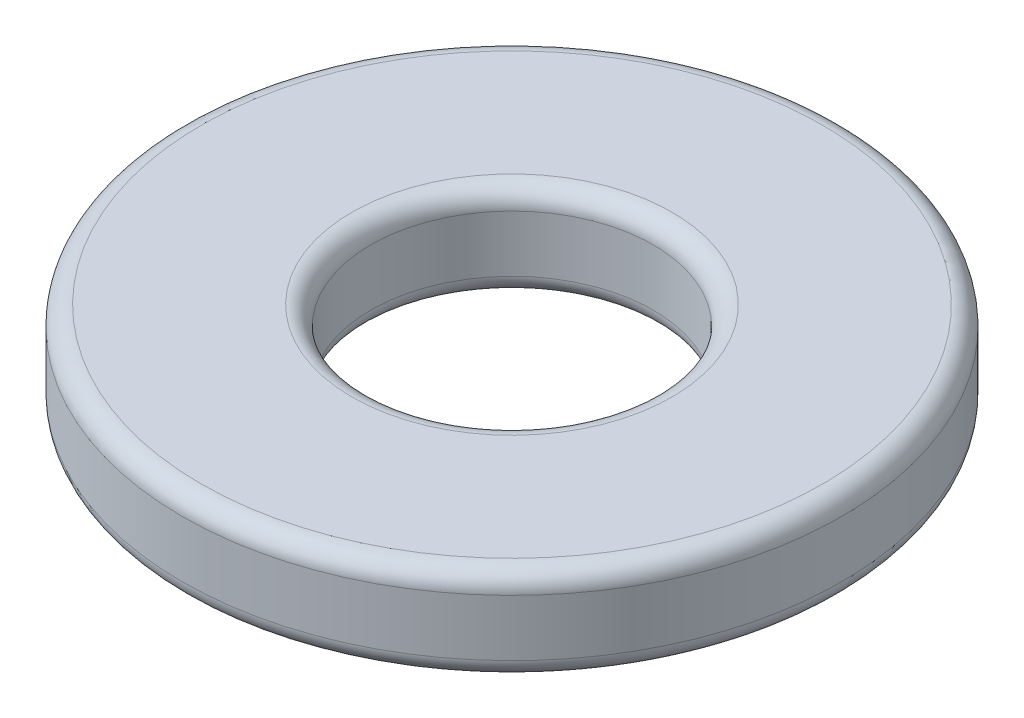
ISO-10303-21;
HEADER;
FILE_DESCRIPTION(('STEP AP214'),'2;1');
FILE_NAME('part.step','',(''),(''),'','','');
FILE_SCHEMA(('AUTOMOTIVE_DESIGN { 1 0 10303 214 1 1 1 1 }'));
ENDSEC;
DATA;
#1=APPLICATION_CONTEXT('core data for automotive mechanical design processes');
#2=APPLICATION_PROTOCOL_DEFINITION('international standard','automotive_design',2000,#1);
#3=PRODUCT_CONTEXT('',#1,'mechanical');
#4=PRODUCT('Part','Part','',(#3));
#5=PRODUCT_RELATED_PRODUCT_CATEGORY('part','',(#4));
#6=PRODUCT_DEFINITION_FORMATION('','',#4);
#7=PRODUCT_DEFINITION_CONTEXT('part definition',#1,'design');
#8=PRODUCT_DEFINITION('design','',#6,#7);
#9=PRODUCT_DEFINITION_SHAPE('','',#8);
#10=(LENGTH_UNIT() NAMED_UNIT(*) SI_UNIT(.MILLI.,.METRE.));
#11=(NAMED_UNIT(*) PLANE_ANGLE_UNIT() SI_UNIT($,.RADIAN.));
#12=(NAMED_UNIT(*) SI_UNIT($,.STERADIAN.) SOLID_ANGLE_UNIT());
#13=UNCERTAINTY_MEASURE_WITH_UNIT(LENGTH_MEASURE(1.E-05),#10,'distance_accuracy_value','');
#14=(GEOMETRIC_REPRESENTATION_CONTEXT(3) GLOBAL_UNCERTAINTY_ASSIGNED_CONTEXT((#13)) GLOBAL_UNIT_ASSIGNED_CONTEXT((#10,
#11,#12)) REPRESENTATION_CONTEXT('',''));
#15=CARTESIAN_POINT('',(0.,0.,0.));
#16=DIRECTION('',(0.,0.,1.));
#17=DIRECTION('',(1.,0.,0.));
#18=AXIS2_PLACEMENT_3D('',#15,#16,#17);
#19=CARTESIAN_POINT('',(0.,1.,0.));
#20=DIRECTION('',(0.,1.,0.));
#21=DIRECTION('',(0.,0.,1.));
#22=AXIS2_PLACEMENT_3D('',#19,#20,#21);
#23=PLANE('',#22);
#24=CARTESIAN_POINT('',(0.,1.,0.));
#25=DIRECTION('',(0.,1.,0.));
#26=DIRECTION('',(0.,0.,1.));
#27=AXIS2_PLACEMENT_3D('',#24,#25,#26);
#28=CIRCLE('',#27,3.3);
#29=CARTESIAN_POINT('',(0.,1.,3.3));
#30=VERTEX_POINT('',#29);
#31=EDGE_CURVE('E58',#30,#30,#28,.T.);
#32=ORIENTED_EDGE('',*,*,#31,.T.);
#33=EDGE_LOOP('',(#32));
#34=FACE_BOUND('',#33,.T.);
#35=CARTESIAN_POINT('',(0.,1.,0.));
#36=DIRECTION('',(0.,1.,0.));
#37=DIRECTION('',(0.,0.,1.));
#38=AXIS2_PLACEMENT_3D('',#35,#36,#37);
#39=CIRCLE('',#38,1.7);
#40=CARTESIAN_POINT('',(0.,1.,1.7));
#41=VERTEX_POINT('',#40);
#42=EDGE_CURVE('E61',#41,#41,#39,.F.);
#43=ORIENTED_EDGE('',*,*,#42,.T.);
#44=EDGE_LOOP('',(#43));
#45=FACE_BOUND('',#44,.T.);
#46=ADVANCED_FACE('F32',(#34,#45),#23,.T.);
#47=CARTESIAN_POINT('',(0.,0.,0.));
#48=DIRECTION('',(0.,1.,0.));
#49=DIRECTION('',(0.,0.,1.));
#50=AXIS2_PLACEMENT_3D('',#47,#48,#49);
#51=PLANE('',#50);
#52=CARTESIAN_POINT('',(0.,0.,0.));
#53=DIRECTION('',(0.,1.,0.));
#54=DIRECTION('',(0.,0.,1.));
#55=AXIS2_PLACEMENT_3D('',#52,#53,#54);
#56=CIRCLE('',#55,3.3);
#57=CARTESIAN_POINT('',(0.,0.,3.3));
#58=VERTEX_POINT('',#57);
#59=EDGE_CURVE('E43',#58,#58,#56,.F.);
#60=ORIENTED_EDGE('',*,*,#59,.T.);
#61=EDGE_LOOP('',(#60));
#62=FACE_BOUND('',#61,.T.);
#63=CARTESIAN_POINT('',(0.,0.,0.));
#64=DIRECTION('',(0.,1.,0.));
#65=DIRECTION('',(0.,0.,1.));
#66=AXIS2_PLACEMENT_3D('',#63,#64,#65);
#67=CIRCLE('',#66,1.7);
#68=CARTESIAN_POINT('',(0.,0.,1.7));
#69=VERTEX_POINT('',#68);
#70=EDGE_CURVE('E47',#69,#69,#67,.T.);
#71=ORIENTED_EDGE('',*,*,#70,.T.);
#72=EDGE_LOOP('',(#71));
#73=FACE_BOUND('',#72,.T.);
#74=ADVANCED_FACE('F75',(#62,#73),#51,.F.);
#75=CARTESIAN_POINT('',(0.,1.,0.));
#76=DIRECTION('',(0.,-1.,0.));
#77=DIRECTION('',(0.,0.,-1.));
#78=AXIS2_PLACEMENT_3D('',#75,#76,#77);
#79=CYLINDRICAL_SURFACE('',#78,3.5);
#80=CARTESIAN_POINT('',(0.,0.8,0.));
#81=DIRECTION('',(0.,1.,0.));
#82=DIRECTION('',(0.,0.,1.));
#83=AXIS2_PLACEMENT_3D('',#80,#81,#82);
#84=CIRCLE('',#83,3.5);
#85=CARTESIAN_POINT('',(0.,0.8,3.5));
#86=VERTEX_POINT('',#85);
#87=EDGE_CURVE('E52',#86,#86,#84,.F.);
#88=ORIENTED_EDGE('',*,*,#87,.T.);
#89=EDGE_LOOP('',(#88));
#90=FACE_BOUND('',#89,.T.);
#91=CARTESIAN_POINT('',(0.,0.2,0.));
#92=DIRECTION('',(0.,1.,0.));
#93=DIRECTION('',(0.,0.,1.));
#94=AXIS2_PLACEMENT_3D('',#91,#92,#93);
#95=CIRCLE('',#94,3.5);
#96=CARTESIAN_POINT('',(0.,0.2,3.5));
#97=VERTEX_POINT('',#96);
#98=EDGE_CURVE('E55',#97,#97,#95,.T.);
#99=ORIENTED_EDGE('',*,*,#98,.T.);
#100=EDGE_LOOP('',(#99));
#101=FACE_BOUND('',#100,.T.);
#102=ADVANCED_FACE('F81',(#90,#101),#79,.T.);
#103=CARTESIAN_POINT('',(0.,1.,0.));
#104=DIRECTION('',(0.,-1.,0.));
#105=DIRECTION('',(0.,0.,-1.));
#106=AXIS2_PLACEMENT_3D('',#103,#104,#105);
#107=CYLINDRICAL_SURFACE('',#106,1.5);
#108=CARTESIAN_POINT('',(0.,0.2,0.));
#109=DIRECTION('',(0.,1.,0.));
#110=DIRECTION('',(0.,0.,1.));
#111=AXIS2_PLACEMENT_3D('',#108,#109,#110);
#112=CIRCLE('',#111,1.5);
#113=CARTESIAN_POINT('',(0.,0.2,1.5));
#114=VERTEX_POINT('',#113);
#115=EDGE_CURVE('E10',#114,#114,#112,.F.);
#116=ORIENTED_EDGE('',*,*,#115,.T.);
#117=EDGE_LOOP('',(#116));
#118=FACE_BOUND('',#117,.T.);
#119=CARTESIAN_POINT('',(0.,0.8,0.));
#120=DIRECTION('',(0.,1.,0.));
#121=DIRECTION('',(0.,0.,1.));
#122=AXIS2_PLACEMENT_3D('',#119,#120,#121);
#123=CIRCLE('',#122,1.5);
#124=CARTESIAN_POINT('',(0.,0.8,1.5));
#125=VERTEX_POINT('',#124);
#126=EDGE_CURVE('E39',#125,#125,#123,.T.);
#127=ORIENTED_EDGE('',*,*,#126,.T.);
#128=EDGE_LOOP('',(#127));
#129=FACE_BOUND('',#128,.T.);
#130=ADVANCED_FACE('F85',(#118,#129),#107,.F.);
#131=CARTESIAN_POINT('',(0.,0.8,0.));
#132=DIRECTION('',(0.,1.,0.));
#133=DIRECTION('',(0.,0.,1.));
#134=AXIS2_PLACEMENT_3D('',#131,#132,#133);
#135=TOROIDAL_SURFACE('',#134,3.3,0.2);
#136=ORIENTED_EDGE('',*,*,#87,.F.);
#137=EDGE_LOOP('',(#136));
#138=FACE_BOUND('',#137,.T.);
#139=ORIENTED_EDGE('',*,*,#31,.F.);
#140=EDGE_LOOP('',(#139));
#141=FACE_BOUND('',#140,.T.);
#142=ADVANCED_FACE('F90',(#138,#141),#135,.T.);
#143=CARTESIAN_POINT('',(0.,0.2,0.));
#144=DIRECTION('',(0.,1.,0.));
#145=DIRECTION('',(0.,0.,1.));
#146=AXIS2_PLACEMENT_3D('',#143,#144,#145);
#147=TOROIDAL_SURFACE('',#146,3.3,0.2);
#148=ORIENTED_EDGE('',*,*,#59,.F.);
#149=EDGE_LOOP('',(#148));
#150=FACE_BOUND('',#149,.T.);
#151=ORIENTED_EDGE('',*,*,#98,.F.);
#152=EDGE_LOOP('',(#151));
#153=FACE_BOUND('',#152,.T.);
#154=ADVANCED_FACE('F72',(#150,#153),#147,.T.);
#155=CARTESIAN_POINT('',(0.,0.2,0.));
#156=DIRECTION('',(0.,1.,0.));
#157=DIRECTION('',(0.,0.,1.));
#158=AXIS2_PLACEMENT_3D('',#155,#156,#157);
#159=TOROIDAL_SURFACE('',#158,1.7,0.2);
#160=ORIENTED_EDGE('',*,*,#115,.F.);
#161=EDGE_LOOP('',(#160));
#162=FACE_BOUND('',#161,.T.);
#163=ORIENTED_EDGE('',*,*,#70,.F.);
#164=EDGE_LOOP('',(#163));
#165=FACE_BOUND('',#164,.T.);
#166=ADVANCED_FACE('F68',(#162,#165),#159,.T.);
#167=CARTESIAN_POINT('',(0.,0.8,0.));
#168=DIRECTION('',(0.,1.,0.));
#169=DIRECTION('',(0.,0.,1.));
#170=AXIS2_PLACEMENT_3D('',#167,#168,#169);
#171=TOROIDAL_SURFACE('',#170,1.7,0.2);
#172=ORIENTED_EDGE('',*,*,#42,.F.);
#173=EDGE_LOOP('',(#172));
#174=FACE_BOUND('',#173,.T.);
#175=ORIENTED_EDGE('',*,*,#126,.F.);
#176=EDGE_LOOP('',(#175));
#177=FACE_BOUND('',#176,.T.);
#178=ADVANCED_FACE('F34',(#174,#177),#171,.T.);
#179=CLOSED_SHELL('',(#46,#74,#102,#130,#142,#154,#166,#178));
#180=MANIFOLD_SOLID_BREP('B2',#179);
#181=ADVANCED_BREP_SHAPE_REPRESENTATION('',(#18,#180),#14);
#182=SHAPE_DEFINITION_REPRESENTATION(#9,#181);
ENDSEC;
END-ISO-10303-21;
